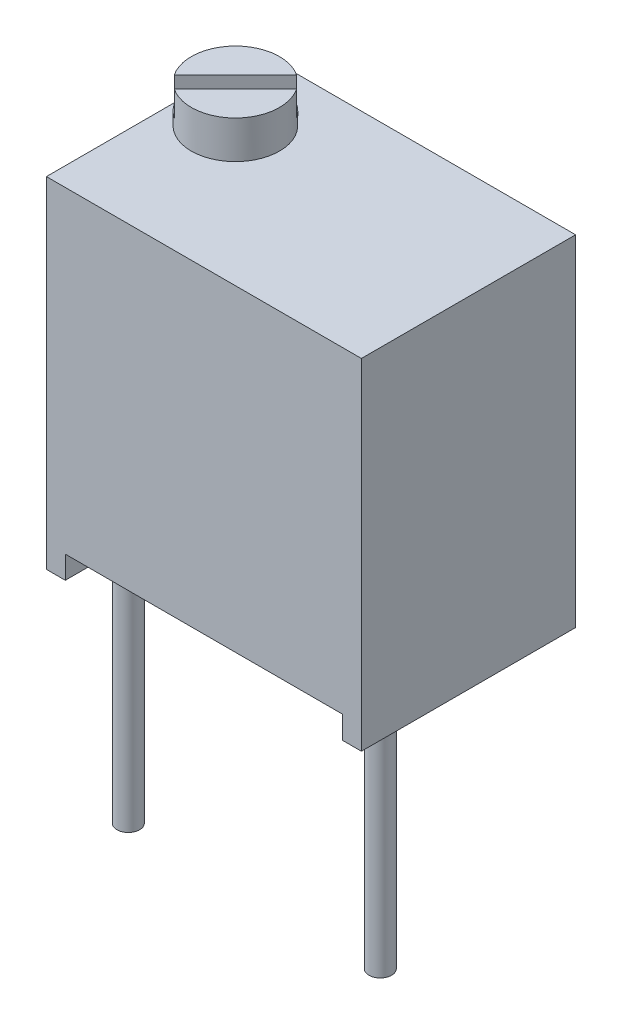
ISO-10303-21;
HEADER;
FILE_DESCRIPTION(('STEP AP214'),'2;1');
FILE_NAME('part.step','',(''),(''),'','','');
FILE_SCHEMA(('AUTOMOTIVE_DESIGN { 1 0 10303 214 1 1 1 1 }'));
ENDSEC;
DATA;
#1=APPLICATION_CONTEXT('core data for automotive mechanical design processes');
#2=APPLICATION_PROTOCOL_DEFINITION('international standard','automotive_design',2000,#1);
#3=PRODUCT_CONTEXT('',#1,'mechanical');
#4=PRODUCT('Part','Part','',(#3));
#5=PRODUCT_RELATED_PRODUCT_CATEGORY('part','',(#4));
#6=PRODUCT_DEFINITION_FORMATION('','',#4);
#7=PRODUCT_DEFINITION_CONTEXT('part definition',#1,'design');
#8=PRODUCT_DEFINITION('design','',#6,#7);
#9=PRODUCT_DEFINITION_SHAPE('','',#8);
#10=(LENGTH_UNIT() NAMED_UNIT(*) SI_UNIT(.MILLI.,.METRE.));
#11=(NAMED_UNIT(*) PLANE_ANGLE_UNIT() SI_UNIT($,.RADIAN.));
#12=(NAMED_UNIT(*) SI_UNIT($,.STERADIAN.) SOLID_ANGLE_UNIT());
#13=UNCERTAINTY_MEASURE_WITH_UNIT(LENGTH_MEASURE(1.E-05),#10,'distance_accuracy_value','');
#14=(GEOMETRIC_REPRESENTATION_CONTEXT(3) GLOBAL_UNCERTAINTY_ASSIGNED_CONTEXT((#13)) GLOBAL_UNIT_ASSIGNED_CONTEXT((#10,
#11,#12)) REPRESENTATION_CONTEXT('',''));
#15=CARTESIAN_POINT('',(0.,0.,0.));
#16=DIRECTION('',(0.,0.,1.));
#17=DIRECTION('',(1.,0.,0.));
#18=AXIS2_PLACEMENT_3D('',#15,#16,#17);
#19=CARTESIAN_POINT('',(-0.254000000000001,0.7112,-3.302));
#20=DIRECTION('',(0.,1.,0.));
#21=DIRECTION('',(-1.,0.,0.));
#22=AXIS2_PLACEMENT_3D('',#19,#20,#21);
#23=PLANE('',#22);
#24=CARTESIAN_POINT('',(5.08,0.7112,0.));
#25=DIRECTION('',(0.,1.,0.));
#26=DIRECTION('',(-1.,0.,0.));
#27=AXIS2_PLACEMENT_3D('',#24,#25,#26);
#28=CIRCLE('',#27,0.2286);
#29=CARTESIAN_POINT('',(4.8514,0.7112,0.));
#30=VERTEX_POINT('',#29);
#31=EDGE_CURVE('E41',#30,#30,#28,.F.);
#32=ORIENTED_EDGE('',*,*,#31,.F.);
#33=EDGE_LOOP('',(#32));
#34=FACE_BOUND('',#33,.T.);
#35=DIRECTION('',(-1.,0.,0.));
#36=VECTOR('',#35,1.);
#37=CARTESIAN_POINT('',(-0.254000000000001,0.7112,1.016));
#38=LINE('',#37,#36);
#39=CARTESIAN_POINT('',(5.334,0.711200000000001,1.016));
#40=VERTEX_POINT('',#39);
#41=CARTESIAN_POINT('',(-0.254000000000001,0.7112,1.016));
#42=VERTEX_POINT('',#41);
#43=EDGE_CURVE('E158',#40,#42,#38,.T.);
#44=ORIENTED_EDGE('',*,*,#43,.T.);
#45=DIRECTION('',(0.,0.,1.));
#46=VECTOR('',#45,1.);
#47=CARTESIAN_POINT('',(-0.254000000000001,0.7112,-3.302));
#48=LINE('',#47,#46);
#49=CARTESIAN_POINT('',(-0.254000000000001,0.7112,-3.302));
#50=VERTEX_POINT('',#49);
#51=EDGE_CURVE('E170',#50,#42,#48,.T.);
#52=ORIENTED_EDGE('',*,*,#51,.F.);
#53=DIRECTION('',(-1.,0.,0.));
#54=VECTOR('',#53,1.);
#55=CARTESIAN_POINT('',(-0.254000000000001,0.7112,-3.302));
#56=LINE('',#55,#54);
#57=CARTESIAN_POINT('',(5.334,0.711200000000001,-3.302));
#58=VERTEX_POINT('',#57);
#59=EDGE_CURVE('E161',#58,#50,#56,.T.);
#60=ORIENTED_EDGE('',*,*,#59,.F.);
#61=DIRECTION('',(0.,0.,1.));
#62=VECTOR('',#61,1.);
#63=CARTESIAN_POINT('',(5.334,0.711200000000001,-3.302));
#64=LINE('',#63,#62);
#65=EDGE_CURVE('E173',#58,#40,#64,.T.);
#66=ORIENTED_EDGE('',*,*,#65,.T.);
#67=EDGE_LOOP('',(#44,#52,#60,#66));
#68=FACE_BOUND('',#67,.T.);
#69=CARTESIAN_POINT('',(0.,0.7112,0.));
#70=DIRECTION('',(0.,1.,0.));
#71=DIRECTION('',(-1.,0.,0.));
#72=AXIS2_PLACEMENT_3D('',#69,#70,#71);
#73=CIRCLE('',#72,0.2286);
#74=CARTESIAN_POINT('',(-0.2286,0.7112,0.));
#75=VERTEX_POINT('',#74);
#76=EDGE_CURVE('E215',#75,#75,#73,.F.);
#77=ORIENTED_EDGE('',*,*,#76,.F.);
#78=EDGE_LOOP('',(#77));
#79=FACE_BOUND('',#78,.T.);
#80=CARTESIAN_POINT('',(2.54,0.7112,-2.54));
#81=DIRECTION('',(0.,1.,0.));
#82=DIRECTION('',(-1.,0.,0.));
#83=AXIS2_PLACEMENT_3D('',#80,#81,#82);
#84=CIRCLE('',#83,0.2286);
#85=CARTESIAN_POINT('',(2.3114,0.7112,-2.54));
#86=VERTEX_POINT('',#85);
#87=EDGE_CURVE('E11',#86,#86,#84,.F.);
#88=ORIENTED_EDGE('',*,*,#87,.F.);
#89=EDGE_LOOP('',(#88));
#90=FACE_BOUND('',#89,.T.);
#91=ADVANCED_FACE('F33',(#34,#68,#79,#90),#23,.F.);
#92=CARTESIAN_POINT('',(0.380999999999999,7.874,-1.778));
#93=DIRECTION('',(0.,1.,0.));
#94=DIRECTION('',(0.,0.,1.));
#95=AXIS2_PLACEMENT_3D('',#92,#93,#94);
#96=PLANE('',#95);
#97=DIRECTION('',(-0.707106781186546,0.,0.707106781186549));
#98=VECTOR('',#97,1.);
#99=CARTESIAN_POINT('',(0.25527641430503,7.874,-1.90372358569497));
#100=LINE('',#99,#98);
#101=CARTESIAN_POINT('',(0.871193681476521,7.874,-2.51964085286646));
#102=VERTEX_POINT('',#101);
#103=CARTESIAN_POINT('',(-0.360640852866462,7.874,-1.28780631852347));
#104=VERTEX_POINT('',#103);
#105=EDGE_CURVE('E129',#102,#104,#100,.T.);
#106=ORIENTED_EDGE('',*,*,#105,.F.);
#107=CARTESIAN_POINT('',(0.380999999999999,7.874,-1.778));
#108=DIRECTION('',(0.,1.,0.));
#109=DIRECTION('',(0.,0.,1.));
#110=AXIS2_PLACEMENT_3D('',#107,#108,#109);
#111=CIRCLE('',#110,0.889);
#112=EDGE_CURVE('E143',#102,#104,#111,.T.);
#113=ORIENTED_EDGE('',*,*,#112,.T.);
#114=EDGE_LOOP('',(#106,#113));
#115=FACE_BOUND('',#114,.T.);
#116=ADVANCED_FACE('F224',(#115),#96,.T.);
#117=CARTESIAN_POINT('',(-0.635000000000001,7.112,-3.302));
#118=DIRECTION('',(0.,1.,0.));
#119=DIRECTION('',(0.,0.,1.));
#120=AXIS2_PLACEMENT_3D('',#117,#118,#119);
#121=PLANE('',#120);
#122=DIRECTION('',(0.,0.,1.));
#123=VECTOR('',#122,1.);
#124=CARTESIAN_POINT('',(-0.635000000000001,7.112,-3.302));
#125=LINE('',#124,#123);
#126=CARTESIAN_POINT('',(-0.635000000000001,7.112,-3.302));
#127=VERTEX_POINT('',#126);
#128=CARTESIAN_POINT('',(-0.635000000000001,7.112,1.016));
#129=VERTEX_POINT('',#128);
#130=EDGE_CURVE('E130',#127,#129,#125,.T.);
#131=ORIENTED_EDGE('',*,*,#130,.T.);
#132=DIRECTION('',(-1.,0.,0.));
#133=VECTOR('',#132,1.);
#134=CARTESIAN_POINT('',(-0.635000000000001,7.112,1.016));
#135=LINE('',#134,#133);
#136=CARTESIAN_POINT('',(5.715,7.112,1.016));
#137=VERTEX_POINT('',#136);
#138=EDGE_CURVE('E187',#137,#129,#135,.T.);
#139=ORIENTED_EDGE('',*,*,#138,.F.);
#140=DIRECTION('',(0.,0.,1.));
#141=VECTOR('',#140,1.);
#142=CARTESIAN_POINT('',(5.715,7.112,-3.302));
#143=LINE('',#142,#141);
#144=CARTESIAN_POINT('',(5.715,7.112,-3.302));
#145=VERTEX_POINT('',#144);
#146=EDGE_CURVE('E205',#145,#137,#143,.T.);
#147=ORIENTED_EDGE('',*,*,#146,.F.);
#148=DIRECTION('',(-1.,0.,0.));
#149=VECTOR('',#148,1.);
#150=CARTESIAN_POINT('',(-0.635000000000001,7.112,-3.302));
#151=LINE('',#150,#149);
#152=EDGE_CURVE('E200',#145,#127,#151,.T.);
#153=ORIENTED_EDGE('',*,*,#152,.T.);
#154=EDGE_LOOP('',(#131,#139,#147,#153));
#155=FACE_BOUND('',#154,.T.);
#156=CARTESIAN_POINT('',(0.380999999999999,7.112,-1.778));
#157=DIRECTION('',(0.,1.,0.));
#158=DIRECTION('',(0.,0.,1.));
#159=AXIS2_PLACEMENT_3D('',#156,#157,#158);
#160=CIRCLE('',#159,0.889);
#161=CARTESIAN_POINT('',(0.380999999999999,7.112,-0.889));
#162=VERTEX_POINT('',#161);
#163=EDGE_CURVE('E144',#162,#162,#160,.T.);
#164=ORIENTED_EDGE('',*,*,#163,.F.);
#165=EDGE_LOOP('',(#164));
#166=FACE_BOUND('',#165,.T.);
#167=ADVANCED_FACE('F290',(#155,#166),#121,.T.);
#168=CARTESIAN_POINT('',(-0.635,0.254000000000001,-3.302));
#169=DIRECTION('',(0.,-1.,0.));
#170=DIRECTION('',(0.,0.,-1.));
#171=AXIS2_PLACEMENT_3D('',#168,#169,#170);
#172=PLANE('',#171);
#173=DIRECTION('',(0.,0.,1.));
#174=VECTOR('',#173,1.);
#175=CARTESIAN_POINT('',(-0.254000000000001,0.254000000000001,-3.302));
#176=LINE('',#175,#174);
#177=CARTESIAN_POINT('',(-0.254000000000001,0.254000000000001,-3.302));
#178=VERTEX_POINT('',#177);
#179=CARTESIAN_POINT('',(-0.254000000000001,0.254000000000001,1.016));
#180=VERTEX_POINT('',#179);
#181=EDGE_CURVE('E164',#178,#180,#176,.T.);
#182=ORIENTED_EDGE('',*,*,#181,.T.);
#183=DIRECTION('',(1.,0.,0.));
#184=VECTOR('',#183,1.);
#185=CARTESIAN_POINT('',(-0.635,0.254000000000001,1.016));
#186=LINE('',#185,#184);
#187=CARTESIAN_POINT('',(-0.635,0.254000000000001,1.016));
#188=VERTEX_POINT('',#187);
#189=EDGE_CURVE('E181',#188,#180,#186,.T.);
#190=ORIENTED_EDGE('',*,*,#189,.F.);
#191=DIRECTION('',(0.,0.,1.));
#192=VECTOR('',#191,1.);
#193=CARTESIAN_POINT('',(-0.635,0.254000000000001,-3.302));
#194=LINE('',#193,#192);
#195=CARTESIAN_POINT('',(-0.635,0.254000000000001,-3.302));
#196=VERTEX_POINT('',#195);
#197=EDGE_CURVE('E203',#196,#188,#194,.T.);
#198=ORIENTED_EDGE('',*,*,#197,.F.);
#199=DIRECTION('',(1.,0.,0.));
#200=VECTOR('',#199,1.);
#201=CARTESIAN_POINT('',(-0.635,0.254000000000001,-3.302));
#202=LINE('',#201,#200);
#203=EDGE_CURVE('E194',#196,#178,#202,.T.);
#204=ORIENTED_EDGE('',*,*,#203,.T.);
#205=EDGE_LOOP('',(#182,#190,#198,#204));
#206=FACE_BOUND('',#205,.T.);
#207=ADVANCED_FACE('F293',(#206),#172,.T.);
#208=CARTESIAN_POINT('',(-0.635000000000001,7.112,-3.302));
#209=DIRECTION('',(-1.,0.,0.));
#210=DIRECTION('',(0.,-1.,0.));
#211=AXIS2_PLACEMENT_3D('',#208,#209,#210);
#212=PLANE('',#211);
#213=ORIENTED_EDGE('',*,*,#197,.T.);
#214=DIRECTION('',(0.,-1.,0.));
#215=VECTOR('',#214,1.);
#216=CARTESIAN_POINT('',(-0.635000000000001,7.112,1.016));
#217=LINE('',#216,#215);
#218=EDGE_CURVE('E172',#129,#188,#217,.T.);
#219=ORIENTED_EDGE('',*,*,#218,.F.);
#220=ORIENTED_EDGE('',*,*,#130,.F.);
#221=DIRECTION('',(0.,-1.,0.));
#222=VECTOR('',#221,1.);
#223=CARTESIAN_POINT('',(-0.635000000000001,7.112,-3.302));
#224=LINE('',#223,#222);
#225=EDGE_CURVE('E190',#127,#196,#224,.T.);
#226=ORIENTED_EDGE('',*,*,#225,.T.);
#227=EDGE_LOOP('',(#213,#219,#220,#226));
#228=FACE_BOUND('',#227,.T.);
#229=ADVANCED_FACE('F35',(#228),#212,.T.);
#230=CARTESIAN_POINT('',(5.715,7.112,-3.302));
#231=DIRECTION('',(1.,0.,0.));
#232=DIRECTION('',(0.,1.,0.));
#233=AXIS2_PLACEMENT_3D('',#230,#231,#232);
#234=PLANE('',#233);
#235=ORIENTED_EDGE('',*,*,#146,.T.);
#236=DIRECTION('',(0.,1.,0.));
#237=VECTOR('',#236,1.);
#238=CARTESIAN_POINT('',(5.715,7.112,1.016));
#239=LINE('',#238,#237);
#240=CARTESIAN_POINT('',(5.715,0.254000000000001,1.016));
#241=VERTEX_POINT('',#240);
#242=EDGE_CURVE('E184',#241,#137,#239,.T.);
#243=ORIENTED_EDGE('',*,*,#242,.F.);
#244=DIRECTION('',(0.,0.,1.));
#245=VECTOR('',#244,1.);
#246=CARTESIAN_POINT('',(5.715,0.254000000000001,-3.302));
#247=LINE('',#246,#245);
#248=CARTESIAN_POINT('',(5.715,0.254000000000001,-3.302));
#249=VERTEX_POINT('',#248);
#250=EDGE_CURVE('E207',#249,#241,#247,.T.);
#251=ORIENTED_EDGE('',*,*,#250,.F.);
#252=DIRECTION('',(0.,1.,0.));
#253=VECTOR('',#252,1.);
#254=CARTESIAN_POINT('',(5.715,7.112,-3.302));
#255=LINE('',#254,#253);
#256=EDGE_CURVE('E197',#249,#145,#255,.T.);
#257=ORIENTED_EDGE('',*,*,#256,.T.);
#258=EDGE_LOOP('',(#235,#243,#251,#257));
#259=FACE_BOUND('',#258,.T.);
#260=ADVANCED_FACE('F295',(#259),#234,.T.);
#261=DIRECTION('',(0.,0.,1.));
#262=VECTOR('',#261,1.);
#263=CARTESIAN_POINT('',(5.334,0.254000000000001,-3.302));
#264=LINE('',#263,#262);
#265=CARTESIAN_POINT('',(5.334,0.254000000000001,-3.302));
#266=VERTEX_POINT('',#265);
#267=CARTESIAN_POINT('',(5.334,0.254000000000001,1.016));
#268=VERTEX_POINT('',#267);
#269=EDGE_CURVE('E56',#266,#268,#264,.T.);
#270=ORIENTED_EDGE('',*,*,#269,.F.);
#271=EDGE_CURVE('E193',#266,#249,#202,.T.);
#272=ORIENTED_EDGE('',*,*,#271,.T.);
#273=ORIENTED_EDGE('',*,*,#250,.T.);
#274=EDGE_CURVE('E180',#268,#241,#186,.T.);
#275=ORIENTED_EDGE('',*,*,#274,.F.);
#276=EDGE_LOOP('',(#270,#272,#273,#275));
#277=FACE_BOUND('',#276,.T.);
#278=ADVANCED_FACE('F288',(#277),#172,.T.);
#279=CARTESIAN_POINT('',(-0.635,0.254000000000001,-3.302));
#280=DIRECTION('',(0.,0.,1.));
#281=DIRECTION('',(1.,0.,0.));
#282=AXIS2_PLACEMENT_3D('',#279,#280,#281);
#283=PLANE('',#282);
#284=ORIENTED_EDGE('',*,*,#59,.T.);
#285=DIRECTION('',(0.,-1.,0.));
#286=VECTOR('',#285,1.);
#287=CARTESIAN_POINT('',(-0.254000000000001,0.7112,-3.302));
#288=LINE('',#287,#286);
#289=EDGE_CURVE('E154',#50,#178,#288,.T.);
#290=ORIENTED_EDGE('',*,*,#289,.T.);
#291=ORIENTED_EDGE('',*,*,#203,.F.);
#292=ORIENTED_EDGE('',*,*,#225,.F.);
#293=ORIENTED_EDGE('',*,*,#152,.F.);
#294=ORIENTED_EDGE('',*,*,#256,.F.);
#295=ORIENTED_EDGE('',*,*,#271,.F.);
#296=DIRECTION('',(0.,1.,0.));
#297=VECTOR('',#296,1.);
#298=CARTESIAN_POINT('',(5.334,0.711200000000001,-3.302));
#299=LINE('',#298,#297);
#300=EDGE_CURVE('E157',#266,#58,#299,.T.);
#301=ORIENTED_EDGE('',*,*,#300,.T.);
#302=EDGE_LOOP('',(#284,#290,#291,#292,#293,#294,#295,#301));
#303=FACE_BOUND('',#302,.T.);
#304=ADVANCED_FACE('F284',(#303),#283,.F.);
#305=CARTESIAN_POINT('',(-0.635,0.254000000000001,1.016));
#306=DIRECTION('',(0.,0.,1.));
#307=DIRECTION('',(1.,0.,0.));
#308=AXIS2_PLACEMENT_3D('',#305,#306,#307);
#309=PLANE('',#308);
#310=DIRECTION('',(0.,-1.,0.));
#311=VECTOR('',#310,1.);
#312=CARTESIAN_POINT('',(-0.254000000000001,0.7112,1.016));
#313=LINE('',#312,#311);
#314=EDGE_CURVE('E147',#42,#180,#313,.T.);
#315=ORIENTED_EDGE('',*,*,#314,.F.);
#316=ORIENTED_EDGE('',*,*,#43,.F.);
#317=DIRECTION('',(0.,1.,0.));
#318=VECTOR('',#317,1.);
#319=CARTESIAN_POINT('',(5.334,0.711200000000001,1.016));
#320=LINE('',#319,#318);
#321=EDGE_CURVE('E166',#268,#40,#320,.T.);
#322=ORIENTED_EDGE('',*,*,#321,.F.);
#323=ORIENTED_EDGE('',*,*,#274,.T.);
#324=ORIENTED_EDGE('',*,*,#242,.T.);
#325=ORIENTED_EDGE('',*,*,#138,.T.);
#326=ORIENTED_EDGE('',*,*,#218,.T.);
#327=ORIENTED_EDGE('',*,*,#189,.T.);
#328=EDGE_LOOP('',(#315,#316,#322,#323,#324,#325,#326,#327));
#329=FACE_BOUND('',#328,.T.);
#330=ADVANCED_FACE('F280',(#329),#309,.T.);
#331=CARTESIAN_POINT('',(-0.254000000000001,0.7112,-3.302));
#332=DIRECTION('',(-1.,0.,0.));
#333=DIRECTION('',(0.,-1.,0.));
#334=AXIS2_PLACEMENT_3D('',#331,#332,#333);
#335=PLANE('',#334);
#336=ORIENTED_EDGE('',*,*,#314,.T.);
#337=ORIENTED_EDGE('',*,*,#181,.F.);
#338=ORIENTED_EDGE('',*,*,#289,.F.);
#339=ORIENTED_EDGE('',*,*,#51,.T.);
#340=EDGE_LOOP('',(#336,#337,#338,#339));
#341=FACE_BOUND('',#340,.T.);
#342=ADVANCED_FACE('F277',(#341),#335,.F.);
#343=CARTESIAN_POINT('',(5.334,0.711200000000001,-3.302));
#344=DIRECTION('',(1.,0.,0.));
#345=DIRECTION('',(0.,0.,-1.));
#346=AXIS2_PLACEMENT_3D('',#343,#344,#345);
#347=PLANE('',#346);
#348=ORIENTED_EDGE('',*,*,#321,.T.);
#349=ORIENTED_EDGE('',*,*,#65,.F.);
#350=ORIENTED_EDGE('',*,*,#300,.F.);
#351=ORIENTED_EDGE('',*,*,#269,.T.);
#352=EDGE_LOOP('',(#348,#349,#350,#351));
#353=FACE_BOUND('',#352,.T.);
#354=ADVANCED_FACE('F273',(#353),#347,.F.);
#355=CARTESIAN_POINT('',(0.380999999999999,7.874,-1.778));
#356=DIRECTION('',(0.,-1.,0.));
#357=DIRECTION('',(0.,0.,-1.));
#358=AXIS2_PLACEMENT_3D('',#355,#356,#357);
#359=CYLINDRICAL_SURFACE('',#358,0.889);
#360=ORIENTED_EDGE('',*,*,#112,.F.);
#361=DIRECTION('',(0.,-1.,0.));
#362=VECTOR('',#361,1.);
#363=CARTESIAN_POINT('',(0.871193681476521,7.874,-2.51964085286646));
#364=LINE('',#363,#362);
#365=CARTESIAN_POINT('',(0.871193681476521,7.366,-2.51964085286646));
#366=VERTEX_POINT('',#365);
#367=EDGE_CURVE('E149',#102,#366,#364,.T.);
#368=ORIENTED_EDGE('',*,*,#367,.T.);
#369=CARTESIAN_POINT('',(0.380999999999999,7.366,-1.778));
#370=DIRECTION('',(0.,-1.,0.));
#371=DIRECTION('',(0.,0.,-1.));
#372=AXIS2_PLACEMENT_3D('',#369,#370,#371);
#373=CIRCLE('',#372,0.889);
#374=CARTESIAN_POINT('',(1.12264085286646,7.366,-2.26819368147653));
#375=VERTEX_POINT('',#374);
#376=EDGE_CURVE('E139',#366,#375,#373,.T.);
#377=ORIENTED_EDGE('',*,*,#376,.T.);
#378=DIRECTION('',(0.,-1.,0.));
#379=VECTOR('',#378,1.);
#380=CARTESIAN_POINT('',(1.12264085286646,7.874,-2.26819368147653));
#381=LINE('',#380,#379);
#382=CARTESIAN_POINT('',(1.12264085286646,7.874,-2.26819368147653));
#383=VERTEX_POINT('',#382);
#384=EDGE_CURVE('E124',#375,#383,#381,.F.);
#385=ORIENTED_EDGE('',*,*,#384,.T.);
#386=CARTESIAN_POINT('',(-0.109193681476524,7.874,-1.03635914713354));
#387=VERTEX_POINT('',#386);
#388=EDGE_CURVE('E137',#387,#383,#111,.T.);
#389=ORIENTED_EDGE('',*,*,#388,.F.);
#390=DIRECTION('',(0.,-1.,0.));
#391=VECTOR('',#390,1.);
#392=CARTESIAN_POINT('',(-0.109193681476524,7.874,-1.03635914713354));
#393=LINE('',#392,#391);
#394=CARTESIAN_POINT('',(-0.109193681476524,7.366,-1.03635914713354));
#395=VERTEX_POINT('',#394);
#396=EDGE_CURVE('E48',#387,#395,#393,.T.);
#397=ORIENTED_EDGE('',*,*,#396,.T.);
#398=CARTESIAN_POINT('',(-0.360640852866461,7.366,-1.28780631852347));
#399=VERTEX_POINT('',#398);
#400=EDGE_CURVE('E212',#395,#399,#373,.T.);
#401=ORIENTED_EDGE('',*,*,#400,.T.);
#402=DIRECTION('',(0.,-1.,0.));
#403=VECTOR('',#402,1.);
#404=CARTESIAN_POINT('',(-0.360640852866461,7.874,-1.28780631852347));
#405=LINE('',#404,#403);
#406=EDGE_CURVE('E473',#399,#104,#405,.F.);
#407=ORIENTED_EDGE('',*,*,#406,.T.);
#408=EDGE_LOOP('',(#360,#368,#377,#385,#389,#397,#401,#407));
#409=FACE_BOUND('',#408,.T.);
#410=ORIENTED_EDGE('',*,*,#163,.T.);
#411=EDGE_LOOP('',(#410));
#412=FACE_BOUND('',#411,.T.);
#413=ADVANCED_FACE('F135',(#409,#412),#359,.T.);
#414=DIRECTION('',(0.707106781186546,0.,-0.707106781186549));
#415=VECTOR('',#414,1.);
#416=CARTESIAN_POINT('',(0.506723585694967,7.874,-1.65227641430503));
#417=LINE('',#416,#415);
#418=EDGE_CURVE('E121',#387,#383,#417,.T.);
#419=ORIENTED_EDGE('',*,*,#418,.F.);
#420=ORIENTED_EDGE('',*,*,#388,.T.);
#421=EDGE_LOOP('',(#419,#420));
#422=FACE_BOUND('',#421,.T.);
#423=ADVANCED_FACE('F142',(#422),#96,.T.);
#424=CARTESIAN_POINT('',(-0.391302026411947,7.366,-0.754250802198114));
#425=DIRECTION('',(0.,-1.,0.));
#426=DIRECTION('',(0.,0.,-1.));
#427=AXIS2_PLACEMENT_3D('',#424,#425,#426);
#428=PLANE('',#427);
#429=DIRECTION('',(-0.707106781186546,0.,0.707106781186549));
#430=VECTOR('',#429,1.);
#431=CARTESIAN_POINT('',(1.15330202641194,7.366,-2.80174919780189));
#432=LINE('',#431,#430);
#433=EDGE_CURVE('E140',#366,#399,#432,.T.);
#434=ORIENTED_EDGE('',*,*,#433,.T.);
#435=ORIENTED_EDGE('',*,*,#400,.F.);
#436=DIRECTION('',(0.707106781186546,0.,-0.707106781186549));
#437=VECTOR('',#436,1.);
#438=CARTESIAN_POINT('',(1.40474919780188,7.366,-2.55030202641195));
#439=LINE('',#438,#437);
#440=EDGE_CURVE('E479',#395,#375,#439,.T.);
#441=ORIENTED_EDGE('',*,*,#440,.T.);
#442=ORIENTED_EDGE('',*,*,#376,.F.);
#443=EDGE_LOOP('',(#434,#435,#441,#442));
#444=FACE_BOUND('',#443,.T.);
#445=ADVANCED_FACE('F260',(#444),#428,.F.);
#446=CARTESIAN_POINT('',(1.15330202641194,7.366,-2.80174919780189));
#447=DIRECTION('',(-0.707106781186549,0.,-0.707106781186546));
#448=DIRECTION('',(-0.707106781186546,0.,0.707106781186549));
#449=AXIS2_PLACEMENT_3D('',#446,#447,#448);
#450=PLANE('',#449);
#451=ORIENTED_EDGE('',*,*,#105,.T.);
#452=ORIENTED_EDGE('',*,*,#406,.F.);
#453=ORIENTED_EDGE('',*,*,#433,.F.);
#454=ORIENTED_EDGE('',*,*,#367,.F.);
#455=EDGE_LOOP('',(#451,#452,#453,#454));
#456=FACE_BOUND('',#455,.T.);
#457=ADVANCED_FACE('F263',(#456),#450,.F.);
#458=CARTESIAN_POINT('',(1.40474919780188,7.366,-2.55030202641195));
#459=DIRECTION('',(0.707106781186549,0.,0.707106781186546));
#460=DIRECTION('',(0.707106781186546,0.,-0.707106781186549));
#461=AXIS2_PLACEMENT_3D('',#458,#459,#460);
#462=PLANE('',#461);
#463=ORIENTED_EDGE('',*,*,#418,.T.);
#464=ORIENTED_EDGE('',*,*,#384,.F.);
#465=ORIENTED_EDGE('',*,*,#440,.F.);
#466=ORIENTED_EDGE('',*,*,#396,.F.);
#467=EDGE_LOOP('',(#463,#464,#465,#466));
#468=FACE_BOUND('',#467,.T.);
#469=ADVANCED_FACE('F123',(#468),#462,.F.);
#470=CARTESIAN_POINT('',(0.,-4.3688,0.));
#471=DIRECTION('',(0.,1.,0.));
#472=DIRECTION('',(-1.,0.,0.));
#473=AXIS2_PLACEMENT_3D('',#470,#471,#472);
#474=CYLINDRICAL_SURFACE('',#473,0.2286);
#475=CARTESIAN_POINT('',(0.,-4.3688,0.));
#476=DIRECTION('',(0.,-1.,0.));
#477=DIRECTION('',(1.,0.,0.));
#478=AXIS2_PLACEMENT_3D('',#475,#476,#477);
#479=CIRCLE('',#478,0.2286);
#480=CARTESIAN_POINT('',(0.2286,-4.3688,0.));
#481=VERTEX_POINT('',#480);
#482=EDGE_CURVE('E481',#481,#481,#479,.T.);
#483=ORIENTED_EDGE('',*,*,#482,.F.);
#484=EDGE_LOOP('',(#483));
#485=FACE_BOUND('',#484,.T.);
#486=ORIENTED_EDGE('',*,*,#76,.T.);
#487=EDGE_LOOP('',(#486));
#488=FACE_BOUND('',#487,.T.);
#489=ADVANCED_FACE('F255',(#485,#488),#474,.T.);
#490=CARTESIAN_POINT('',(0.,-4.3688,0.));
#491=DIRECTION('',(0.,-1.,0.));
#492=DIRECTION('',(1.,0.,0.));
#493=AXIS2_PLACEMENT_3D('',#490,#491,#492);
#494=PLANE('',#493);
#495=ORIENTED_EDGE('',*,*,#482,.T.);
#496=EDGE_LOOP('',(#495));
#497=FACE_BOUND('',#496,.T.);
#498=ADVANCED_FACE('F251',(#497),#494,.T.);
#499=CARTESIAN_POINT('',(5.08,-4.3688,0.));
#500=DIRECTION('',(0.,1.,0.));
#501=DIRECTION('',(-1.,0.,0.));
#502=AXIS2_PLACEMENT_3D('',#499,#500,#501);
#503=CYLINDRICAL_SURFACE('',#502,0.2286);
#504=CARTESIAN_POINT('',(5.08,-4.3688,0.));
#505=DIRECTION('',(0.,-1.,0.));
#506=DIRECTION('',(1.,0.,0.));
#507=AXIS2_PLACEMENT_3D('',#504,#505,#506);
#508=CIRCLE('',#507,0.2286);
#509=CARTESIAN_POINT('',(5.3086,-4.3688,0.));
#510=VERTEX_POINT('',#509);
#511=EDGE_CURVE('E484',#510,#510,#508,.T.);
#512=ORIENTED_EDGE('',*,*,#511,.F.);
#513=EDGE_LOOP('',(#512));
#514=FACE_BOUND('',#513,.T.);
#515=ORIENTED_EDGE('',*,*,#31,.T.);
#516=EDGE_LOOP('',(#515));
#517=FACE_BOUND('',#516,.T.);
#518=ADVANCED_FACE('F220',(#514,#517),#503,.T.);
#519=CARTESIAN_POINT('',(5.08,-4.3688,0.));
#520=DIRECTION('',(0.,-1.,0.));
#521=DIRECTION('',(1.,0.,0.));
#522=AXIS2_PLACEMENT_3D('',#519,#520,#521);
#523=PLANE('',#522);
#524=ORIENTED_EDGE('',*,*,#511,.T.);
#525=EDGE_LOOP('',(#524));
#526=FACE_BOUND('',#525,.T.);
#527=ADVANCED_FACE('F236',(#526),#523,.T.);
#528=CARTESIAN_POINT('',(2.54,-4.3688,-2.54));
#529=DIRECTION('',(0.,1.,0.));
#530=DIRECTION('',(-1.,0.,0.));
#531=AXIS2_PLACEMENT_3D('',#528,#529,#530);
#532=CYLINDRICAL_SURFACE('',#531,0.2286);
#533=CARTESIAN_POINT('',(2.54,-4.3688,-2.54));
#534=DIRECTION('',(0.,-1.,0.));
#535=DIRECTION('',(1.,0.,0.));
#536=AXIS2_PLACEMENT_3D('',#533,#534,#535);
#537=CIRCLE('',#536,0.2286);
#538=CARTESIAN_POINT('',(2.7686,-4.3688,-2.54));
#539=VERTEX_POINT('',#538);
#540=EDGE_CURVE('E487',#539,#539,#537,.T.);
#541=ORIENTED_EDGE('',*,*,#540,.F.);
#542=EDGE_LOOP('',(#541));
#543=FACE_BOUND('',#542,.T.);
#544=ORIENTED_EDGE('',*,*,#87,.T.);
#545=EDGE_LOOP('',(#544));
#546=FACE_BOUND('',#545,.T.);
#547=ADVANCED_FACE('F233',(#543,#546),#532,.T.);
#548=CARTESIAN_POINT('',(2.54,-4.3688,-2.54));
#549=DIRECTION('',(0.,-1.,0.));
#550=DIRECTION('',(1.,0.,0.));
#551=AXIS2_PLACEMENT_3D('',#548,#549,#550);
#552=PLANE('',#551);
#553=ORIENTED_EDGE('',*,*,#540,.T.);
#554=EDGE_LOOP('',(#553));
#555=FACE_BOUND('',#554,.T.);
#556=ADVANCED_FACE('F235',(#555),#552,.T.);
#557=CLOSED_SHELL('',(#91,#116,#167,#207,#229,#260,#278,#304,#330,#342,#354,#413,#423,#445,#457,
#469,#489,#498,#518,#527,#547,#556));
#558=MANIFOLD_SOLID_BREP('B2',#557);
#559=ADVANCED_BREP_SHAPE_REPRESENTATION('',(#18,#558),#14);
#560=SHAPE_DEFINITION_REPRESENTATION(#9,#559);
ENDSEC;
END-ISO-10303-21;
